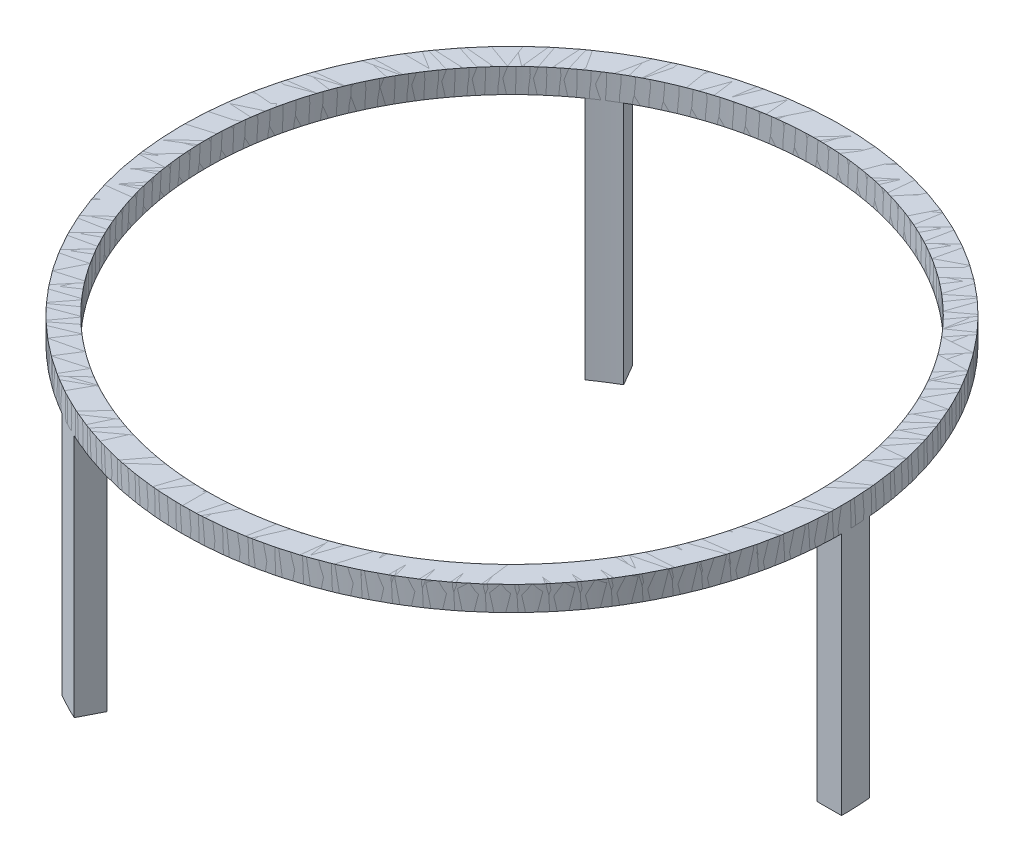
ISO-10303-21;
HEADER;
FILE_DESCRIPTION(('STEP AP214'),'2;1');
FILE_NAME('part.step','',(''),(''),'','','');
FILE_SCHEMA(('AUTOMOTIVE_DESIGN { 1 0 10303 214 1 1 1 1 }'));
ENDSEC;
DATA;
#1=APPLICATION_CONTEXT('core data for automotive mechanical design processes');
#2=APPLICATION_PROTOCOL_DEFINITION('international standard','automotive_design',2000,#1);
#3=PRODUCT_CONTEXT('',#1,'mechanical');
#4=PRODUCT('Part','Part','',(#3));
#5=PRODUCT_RELATED_PRODUCT_CATEGORY('part','',(#4));
#6=PRODUCT_DEFINITION_FORMATION('','',#4);
#7=PRODUCT_DEFINITION_CONTEXT('part definition',#1,'design');
#8=PRODUCT_DEFINITION('design','',#6,#7);
#9=PRODUCT_DEFINITION_SHAPE('','',#8);
#10=(LENGTH_UNIT() NAMED_UNIT(*) SI_UNIT(.MILLI.,.METRE.));
#11=(NAMED_UNIT(*) PLANE_ANGLE_UNIT() SI_UNIT($,.RADIAN.));
#12=(NAMED_UNIT(*) SI_UNIT($,.STERADIAN.) SOLID_ANGLE_UNIT());
#13=UNCERTAINTY_MEASURE_WITH_UNIT(LENGTH_MEASURE(1.E-05),#10,'distance_accuracy_value','');
#14=(GEOMETRIC_REPRESENTATION_CONTEXT(3) GLOBAL_UNCERTAINTY_ASSIGNED_CONTEXT((#13)) GLOBAL_UNIT_ASSIGNED_CONTEXT((#10,
#11,#12)) REPRESENTATION_CONTEXT('',''));
#15=CARTESIAN_POINT('',(0.,0.,0.));
#16=DIRECTION('',(0.,0.,1.));
#17=DIRECTION('',(1.,0.,0.));
#18=AXIS2_PLACEMENT_3D('',#15,#16,#17);
#19=CARTESIAN_POINT('',(0.,0.,0.));
#20=DIRECTION('',(0.,1.,0.));
#21=DIRECTION('',(-0.866025403784443,0.,-0.499999999999992));
#22=AXIS2_PLACEMENT_3D('',#19,#20,#21);
#23=PLANE('',#22);
#24=DIRECTION('',(0.498236668849339,0.,-0.867041072737569));
#25=VECTOR('',#24,1.);
#26=CARTESIAN_POINT('',(-62.499999999999,0.,108.253175473055));
#27=LINE('',#26,#25);
#28=CARTESIAN_POINT('',(-67.4823762401687,0.,116.923602822443));
#29=VERTEX_POINT('',#28);
#30=CARTESIAN_POINT('',(-62.499999999999,0.,108.253175473055));
#31=VERTEX_POINT('',#30);
#32=EDGE_CURVE('E111',#29,#31,#27,.T.);
#33=ORIENTED_EDGE('',*,*,#32,.F.);
#34=CARTESIAN_POINT('',(0.,0.,0.));
#35=DIRECTION('',(0.,1.,0.));
#36=DIRECTION('',(-0.866025403784443,0.,-0.499999999999992));
#37=AXIS2_PLACEMENT_3D('',#34,#35,#36);
#38=CIRCLE('',#37,135.);
#39=CARTESIAN_POINT('',(-56.9282208981994,0.,122.409875685607));
#40=VERTEX_POINT('',#39);
#41=EDGE_CURVE('E54',#40,#29,#38,.T.);
#42=ORIENTED_EDGE('',*,*,#41,.F.);
#43=DIRECTION('',(-0.456347061510745,0.,0.889801865277045));
#44=VECTOR('',#43,1.);
#45=CARTESIAN_POINT('',(-52.3610804507896,0.,113.504701462212));
#46=LINE('',#45,#44);
#47=CARTESIAN_POINT('',(-52.3610804507896,0.,113.504701462212));
#48=VERTEX_POINT('',#47);
#49=EDGE_CURVE('E66',#48,#40,#46,.T.);
#50=ORIENTED_EDGE('',*,*,#49,.F.);
#51=CARTESIAN_POINT('',(0.,0.,0.));
#52=DIRECTION('',(0.,1.,0.));
#53=DIRECTION('',(-0.866025403784443,0.,-0.499999999999992));
#54=AXIS2_PLACEMENT_3D('',#51,#52,#53);
#55=CIRCLE('',#54,125.);
#56=EDGE_CURVE('E70',#48,#31,#55,.T.);
#57=ORIENTED_EDGE('',*,*,#56,.T.);
#58=EDGE_LOOP('',(#33,#42,#50,#57));
#59=FACE_BOUND('',#58,.T.);
#60=ADVANCED_FACE('F50',(#59),#23,.F.);
#61=CARTESIAN_POINT('',(0.,10.,0.));
#62=DIRECTION('',(0.,1.,0.));
#63=DIRECTION('',(-0.866025403784443,0.,-0.499999999999992));
#64=AXIS2_PLACEMENT_3D('',#61,#62,#63);
#65=PLANE('',#64);
#66=CARTESIAN_POINT('',(0.,10.,0.));
#67=DIRECTION('',(0.,1.,0.));
#68=DIRECTION('',(-0.866025403784443,0.,-0.499999999999992));
#69=AXIS2_PLACEMENT_3D('',#66,#67,#68);
#70=CIRCLE('',#69,135.);
#71=CARTESIAN_POINT('',(-116.9134295109,10.,-67.4999999999989));
#72=VERTEX_POINT('',#71);
#73=EDGE_CURVE('E12',#72,#72,#70,.T.);
#74=ORIENTED_EDGE('',*,*,#73,.T.);
#75=EDGE_LOOP('',(#74));
#76=FACE_BOUND('',#75,.T.);
#77=CARTESIAN_POINT('',(0.,10.,0.));
#78=DIRECTION('',(0.,1.,0.));
#79=DIRECTION('',(-0.866025403784443,0.,-0.499999999999992));
#80=AXIS2_PLACEMENT_3D('',#77,#78,#79);
#81=CIRCLE('',#80,125.);
#82=CARTESIAN_POINT('',(-108.253175473055,10.,-62.499999999999));
#83=VERTEX_POINT('',#82);
#84=EDGE_CURVE('E118',#83,#83,#81,.T.);
#85=ORIENTED_EDGE('',*,*,#84,.F.);
#86=EDGE_LOOP('',(#85));
#87=FACE_BOUND('',#86,.T.);
#88=ADVANCED_FACE('F148',(#76,#87),#65,.T.);
#89=CARTESIAN_POINT('',(0.,10.,0.));
#90=DIRECTION('',(0.,-1.,0.));
#91=DIRECTION('',(0.866025403784443,0.,0.499999999999992));
#92=AXIS2_PLACEMENT_3D('',#89,#90,#91);
#93=CYLINDRICAL_SURFACE('',#92,135.);
#94=ORIENTED_EDGE('',*,*,#73,.F.);
#95=EDGE_LOOP('',(#94));
#96=FACE_BOUND('',#95,.T.);
#97=ORIENTED_EDGE('',*,*,#41,.T.);
#98=DIRECTION('',(0.,1.,0.));
#99=VECTOR('',#98,1.);
#100=CARTESIAN_POINT('',(-67.4823762401687,-100.,116.923602822443));
#101=LINE('',#100,#99);
#102=CARTESIAN_POINT('',(-67.4823762401687,-100.,116.923602822443));
#103=VERTEX_POINT('',#102);
#104=EDGE_CURVE('E120',#103,#29,#101,.T.);
#105=ORIENTED_EDGE('',*,*,#104,.F.);
#106=CARTESIAN_POINT('',(0.,-100.,0.));
#107=DIRECTION('',(0.,-1.,0.));
#108=DIRECTION('',(-0.866025403784443,0.,-0.499999999999992));
#109=AXIS2_PLACEMENT_3D('',#106,#107,#108);
#110=CIRCLE('',#109,135.);
#111=CARTESIAN_POINT('',(-56.9282208981994,-100.,122.409875685607));
#112=VERTEX_POINT('',#111);
#113=EDGE_CURVE('E100',#112,#103,#110,.T.);
#114=ORIENTED_EDGE('',*,*,#113,.F.);
#115=DIRECTION('',(0.,1.,0.));
#116=VECTOR('',#115,1.);
#117=CARTESIAN_POINT('',(-56.9282208981994,-100.,122.409875685607));
#118=LINE('',#117,#116);
#119=EDGE_CURVE('E96',#112,#40,#118,.T.);
#120=ORIENTED_EDGE('',*,*,#119,.T.);
#121=EDGE_LOOP('',(#97,#105,#114,#120));
#122=FACE_BOUND('',#121,.T.);
#123=ADVANCED_FACE('F52',(#96,#122),#93,.T.);
#124=CARTESIAN_POINT('',(0.,10.,0.));
#125=DIRECTION('',(0.,-1.,0.));
#126=DIRECTION('',(0.866025403784443,0.,0.499999999999992));
#127=AXIS2_PLACEMENT_3D('',#124,#125,#126);
#128=CYLINDRICAL_SURFACE('',#127,125.);
#129=ORIENTED_EDGE('',*,*,#84,.T.);
#130=EDGE_LOOP('',(#129));
#131=FACE_BOUND('',#130,.T.);
#132=ORIENTED_EDGE('',*,*,#56,.F.);
#133=DIRECTION('',(0.,1.,0.));
#134=VECTOR('',#133,1.);
#135=CARTESIAN_POINT('',(-52.3610804507896,-100.,113.504701462212));
#136=LINE('',#135,#134);
#137=CARTESIAN_POINT('',(-52.3610804507896,-100.,113.504701462212));
#138=VERTEX_POINT('',#137);
#139=EDGE_CURVE('E94',#138,#48,#136,.T.);
#140=ORIENTED_EDGE('',*,*,#139,.F.);
#141=CARTESIAN_POINT('',(0.,-100.,0.));
#142=DIRECTION('',(0.,1.,0.));
#143=DIRECTION('',(-0.866025403784443,0.,-0.499999999999992));
#144=AXIS2_PLACEMENT_3D('',#141,#142,#143);
#145=CIRCLE('',#144,125.);
#146=CARTESIAN_POINT('',(-62.499999999999,-100.,108.253175473055));
#147=VERTEX_POINT('',#146);
#148=EDGE_CURVE('E101',#147,#138,#145,.T.);
#149=ORIENTED_EDGE('',*,*,#148,.F.);
#150=DIRECTION('',(0.,1.,0.));
#151=VECTOR('',#150,1.);
#152=CARTESIAN_POINT('',(-62.499999999999,-100.,108.253175473055));
#153=LINE('',#152,#151);
#154=EDGE_CURVE('E136',#147,#31,#153,.T.);
#155=ORIENTED_EDGE('',*,*,#154,.T.);
#156=EDGE_LOOP('',(#132,#140,#149,#155));
#157=FACE_BOUND('',#156,.T.);
#158=ADVANCED_FACE('F113',(#131,#157),#128,.F.);
#159=CARTESIAN_POINT('',(-52.3610804507896,-100.,113.504701462212));
#160=DIRECTION('',(-0.889801865277045,0.,-0.456347061510745));
#161=DIRECTION('',(-0.456347061510745,0.,0.889801865277045));
#162=AXIS2_PLACEMENT_3D('',#159,#160,#161);
#163=PLANE('',#162);
#164=ORIENTED_EDGE('',*,*,#49,.T.);
#165=ORIENTED_EDGE('',*,*,#119,.F.);
#166=DIRECTION('',(-0.456347061510745,0.,0.889801865277045));
#167=VECTOR('',#166,1.);
#168=CARTESIAN_POINT('',(-52.3610804507896,-100.,113.504701462212));
#169=LINE('',#168,#167);
#170=EDGE_CURVE('E90',#138,#112,#169,.T.);
#171=ORIENTED_EDGE('',*,*,#170,.F.);
#172=ORIENTED_EDGE('',*,*,#139,.T.);
#173=EDGE_LOOP('',(#164,#165,#171,#172));
#174=FACE_BOUND('',#173,.T.);
#175=ADVANCED_FACE('F92',(#174),#163,.F.);
#176=CARTESIAN_POINT('',(-62.499999999999,-100.,108.253175473055));
#177=DIRECTION('',(0.867041072737569,0.,0.498236668849339));
#178=DIRECTION('',(0.498236668849339,0.,-0.867041072737569));
#179=AXIS2_PLACEMENT_3D('',#176,#177,#178);
#180=PLANE('',#179);
#181=ORIENTED_EDGE('',*,*,#32,.T.);
#182=ORIENTED_EDGE('',*,*,#154,.F.);
#183=DIRECTION('',(0.498236668849339,0.,-0.867041072737569));
#184=VECTOR('',#183,1.);
#185=CARTESIAN_POINT('',(-62.499999999999,-100.,108.253175473055));
#186=LINE('',#185,#184);
#187=EDGE_CURVE('E106',#103,#147,#186,.T.);
#188=ORIENTED_EDGE('',*,*,#187,.F.);
#189=ORIENTED_EDGE('',*,*,#104,.T.);
#190=EDGE_LOOP('',(#181,#182,#188,#189));
#191=FACE_BOUND('',#190,.T.);
#192=ADVANCED_FACE('F134',(#191),#180,.F.);
#193=CARTESIAN_POINT('',(0.,-100.,0.));
#194=DIRECTION('',(0.,1.,0.));
#195=DIRECTION('',(-0.866025403784443,0.,-0.499999999999992));
#196=AXIS2_PLACEMENT_3D('',#193,#194,#195);
#197=PLANE('',#196);
#198=ORIENTED_EDGE('',*,*,#148,.T.);
#199=ORIENTED_EDGE('',*,*,#170,.T.);
#200=ORIENTED_EDGE('',*,*,#113,.T.);
#201=ORIENTED_EDGE('',*,*,#187,.T.);
#202=EDGE_LOOP('',(#198,#199,#200,#201));
#203=FACE_BOUND('',#202,.T.);
#204=ADVANCED_FACE('F104',(#203),#197,.F.);
#205=CLOSED_SHELL('',(#60,#88,#123,#158,#175,#192,#204));
#206=MANIFOLD_SOLID_BREP('B2',#205);
#207=CARTESIAN_POINT('',(0.,0.,0.));
#208=DIRECTION('',(0.,1.,0.));
#209=DIRECTION('',(0.866025403784436,0.,-0.500000000000004));
#210=AXIS2_PLACEMENT_3D('',#207,#208,#209);
#211=PLANE('',#210);
#212=DIRECTION('',(0.501761260690572,0.,0.865006148689249));
#213=VECTOR('',#212,1.);
#214=CARTESIAN_POINT('',(-62.5000000000005,0.,-108.253175473055));
#215=LINE('',#214,#213);
#216=CARTESIAN_POINT('',(-67.5176222261524,0.,-116.903253542947));
#217=VERTEX_POINT('',#216);
#218=CARTESIAN_POINT('',(-62.5000000000005,0.,-108.253175473055));
#219=VERTEX_POINT('',#218);
#220=EDGE_CURVE('E282',#217,#219,#215,.T.);
#221=ORIENTED_EDGE('',*,*,#220,.F.);
#222=CARTESIAN_POINT('',(0.,0.,0.));
#223=DIRECTION('',(0.,1.,0.));
#224=DIRECTION('',(0.866025403784436,0.,-0.500000000000004));
#225=AXIS2_PLACEMENT_3D('',#222,#223,#224);
#226=CIRCLE('',#225,135.);
#227=CARTESIAN_POINT('',(-77.5459515687307,0.,-110.506223332897));
#228=VERTEX_POINT('',#227);
#229=EDGE_CURVE('E228',#228,#217,#226,.T.);
#230=ORIENTED_EDGE('',*,*,#229,.F.);
#231=DIRECTION('',(-0.542417488909323,0.,-0.84010908084921));
#232=VECTOR('',#231,1.);
#233=CARTESIAN_POINT('',(-72.1174146898493,0.,-102.098376571091));
#234=LINE('',#233,#232);
#235=CARTESIAN_POINT('',(-72.1174146898494,0.,-102.098376571091));
#236=VERTEX_POINT('',#235);
#237=EDGE_CURVE('E239',#236,#228,#234,.T.);
#238=ORIENTED_EDGE('',*,*,#237,.F.);
#239=CARTESIAN_POINT('',(0.,0.,0.));
#240=DIRECTION('',(0.,1.,0.));
#241=DIRECTION('',(0.866025403784436,0.,-0.500000000000004));
#242=AXIS2_PLACEMENT_3D('',#239,#240,#241);
#243=CIRCLE('',#242,125.);
#244=EDGE_CURVE('E243',#236,#219,#243,.T.);
#245=ORIENTED_EDGE('',*,*,#244,.T.);
#246=EDGE_LOOP('',(#221,#230,#238,#245));
#247=FACE_BOUND('',#246,.T.);
#248=ADVANCED_FACE('F224',(#247),#211,.F.);
#249=CARTESIAN_POINT('',(0.,10.,0.));
#250=DIRECTION('',(0.,1.,0.));
#251=DIRECTION('',(0.866025403784436,0.,-0.500000000000004));
#252=AXIS2_PLACEMENT_3D('',#249,#250,#251);
#253=PLANE('',#252);
#254=CARTESIAN_POINT('',(0.,10.,0.));
#255=DIRECTION('',(0.,1.,0.));
#256=DIRECTION('',(0.866025403784436,0.,-0.500000000000004));
#257=AXIS2_PLACEMENT_3D('',#254,#255,#256);
#258=CIRCLE('',#257,135.);
#259=CARTESIAN_POINT('',(116.913429510899,10.,-67.5000000000006));
#260=VERTEX_POINT('',#259);
#261=EDGE_CURVE('E48',#260,#260,#258,.T.);
#262=ORIENTED_EDGE('',*,*,#261,.T.);
#263=EDGE_LOOP('',(#262));
#264=FACE_BOUND('',#263,.T.);
#265=CARTESIAN_POINT('',(0.,10.,0.));
#266=DIRECTION('',(0.,1.,0.));
#267=DIRECTION('',(0.866025403784436,0.,-0.500000000000004));
#268=AXIS2_PLACEMENT_3D('',#265,#266,#267);
#269=CIRCLE('',#268,125.);
#270=CARTESIAN_POINT('',(108.253175473055,10.,-62.5000000000005));
#271=VERTEX_POINT('',#270);
#272=EDGE_CURVE('E286',#271,#271,#269,.T.);
#273=ORIENTED_EDGE('',*,*,#272,.F.);
#274=EDGE_LOOP('',(#273));
#275=FACE_BOUND('',#274,.T.);
#276=ADVANCED_FACE('F308',(#264,#275),#253,.T.);
#277=CARTESIAN_POINT('',(0.,10.,0.));
#278=DIRECTION('',(0.,-1.,0.));
#279=DIRECTION('',(-0.866025403784436,0.,0.500000000000004));
#280=AXIS2_PLACEMENT_3D('',#277,#278,#279);
#281=CYLINDRICAL_SURFACE('',#280,135.);
#282=ORIENTED_EDGE('',*,*,#261,.F.);
#283=EDGE_LOOP('',(#282));
#284=FACE_BOUND('',#283,.T.);
#285=ORIENTED_EDGE('',*,*,#229,.T.);
#286=DIRECTION('',(0.,1.,0.));
#287=VECTOR('',#286,1.);
#288=CARTESIAN_POINT('',(-67.5176222261524,-100.,-116.903253542947));
#289=LINE('',#288,#287);
#290=CARTESIAN_POINT('',(-67.5176222261524,-100.,-116.903253542947));
#291=VERTEX_POINT('',#290);
#292=EDGE_CURVE('E288',#291,#217,#289,.T.);
#293=ORIENTED_EDGE('',*,*,#292,.F.);
#294=CARTESIAN_POINT('',(0.,-100.,0.));
#295=DIRECTION('',(0.,-1.,0.));
#296=DIRECTION('',(0.866025403784436,0.,-0.500000000000004));
#297=AXIS2_PLACEMENT_3D('',#294,#295,#296);
#298=CIRCLE('',#297,135.);
#299=CARTESIAN_POINT('',(-77.5459515687307,-100.,-110.506223332897));
#300=VERTEX_POINT('',#299);
#301=EDGE_CURVE('E272',#300,#291,#298,.T.);
#302=ORIENTED_EDGE('',*,*,#301,.F.);
#303=DIRECTION('',(0.,1.,0.));
#304=VECTOR('',#303,1.);
#305=CARTESIAN_POINT('',(-77.5459515687307,-100.,-110.506223332897));
#306=LINE('',#305,#304);
#307=EDGE_CURVE('E269',#300,#228,#306,.T.);
#308=ORIENTED_EDGE('',*,*,#307,.T.);
#309=EDGE_LOOP('',(#285,#293,#302,#308));
#310=FACE_BOUND('',#309,.T.);
#311=ADVANCED_FACE('F226',(#284,#310),#281,.T.);
#312=CARTESIAN_POINT('',(0.,10.,0.));
#313=DIRECTION('',(0.,-1.,0.));
#314=DIRECTION('',(-0.866025403784436,0.,0.500000000000004));
#315=AXIS2_PLACEMENT_3D('',#312,#313,#314);
#316=CYLINDRICAL_SURFACE('',#315,125.);
#317=ORIENTED_EDGE('',*,*,#272,.T.);
#318=EDGE_LOOP('',(#317));
#319=FACE_BOUND('',#318,.T.);
#320=ORIENTED_EDGE('',*,*,#244,.F.);
#321=DIRECTION('',(0.,1.,0.));
#322=VECTOR('',#321,1.);
#323=CARTESIAN_POINT('',(-72.1174146898493,-100.,-102.098376571091));
#324=LINE('',#323,#322);
#325=CARTESIAN_POINT('',(-72.1174146898493,-100.,-102.098376571091));
#326=VERTEX_POINT('',#325);
#327=EDGE_CURVE('E267',#326,#236,#324,.T.);
#328=ORIENTED_EDGE('',*,*,#327,.F.);
#329=CARTESIAN_POINT('',(0.,-100.,0.));
#330=DIRECTION('',(0.,1.,0.));
#331=DIRECTION('',(0.866025403784436,0.,-0.500000000000004));
#332=AXIS2_PLACEMENT_3D('',#329,#330,#331);
#333=CIRCLE('',#332,125.);
#334=CARTESIAN_POINT('',(-62.5000000000005,-100.,-108.253175473055));
#335=VERTEX_POINT('',#334);
#336=EDGE_CURVE('E273',#335,#326,#333,.T.);
#337=ORIENTED_EDGE('',*,*,#336,.F.);
#338=DIRECTION('',(0.,1.,0.));
#339=VECTOR('',#338,1.);
#340=CARTESIAN_POINT('',(-62.5000000000005,-100.,-108.253175473055));
#341=LINE('',#340,#339);
#342=EDGE_CURVE('E301',#335,#219,#341,.T.);
#343=ORIENTED_EDGE('',*,*,#342,.T.);
#344=EDGE_LOOP('',(#320,#328,#337,#343));
#345=FACE_BOUND('',#344,.T.);
#346=ADVANCED_FACE('F284',(#319,#345),#316,.F.);
#347=CARTESIAN_POINT('',(-72.1174146898493,-100.,-102.098376571091));
#348=DIRECTION('',(0.84010908084921,0.,-0.542417488909323));
#349=DIRECTION('',(-0.542417488909323,0.,-0.84010908084921));
#350=AXIS2_PLACEMENT_3D('',#347,#348,#349);
#351=PLANE('',#350);
#352=ORIENTED_EDGE('',*,*,#237,.T.);
#353=ORIENTED_EDGE('',*,*,#307,.F.);
#354=DIRECTION('',(-0.542417488909323,0.,-0.84010908084921));
#355=VECTOR('',#354,1.);
#356=CARTESIAN_POINT('',(-72.1174146898493,-100.,-102.098376571091));
#357=LINE('',#356,#355);
#358=EDGE_CURVE('E263',#326,#300,#357,.T.);
#359=ORIENTED_EDGE('',*,*,#358,.F.);
#360=ORIENTED_EDGE('',*,*,#327,.T.);
#361=EDGE_LOOP('',(#352,#353,#359,#360));
#362=FACE_BOUND('',#361,.T.);
#363=ADVANCED_FACE('F265',(#362),#351,.F.);
#364=CARTESIAN_POINT('',(-62.5000000000005,-100.,-108.253175473055));
#365=DIRECTION('',(-0.865006148689249,0.,0.501761260690572));
#366=DIRECTION('',(0.501761260690572,0.,0.865006148689249));
#367=AXIS2_PLACEMENT_3D('',#364,#365,#366);
#368=PLANE('',#367);
#369=ORIENTED_EDGE('',*,*,#220,.T.);
#370=ORIENTED_EDGE('',*,*,#342,.F.);
#371=DIRECTION('',(0.501761260690572,0.,0.865006148689249));
#372=VECTOR('',#371,1.);
#373=CARTESIAN_POINT('',(-62.5000000000005,-100.,-108.253175473055));
#374=LINE('',#373,#372);
#375=EDGE_CURVE('E278',#291,#335,#374,.T.);
#376=ORIENTED_EDGE('',*,*,#375,.F.);
#377=ORIENTED_EDGE('',*,*,#292,.T.);
#378=EDGE_LOOP('',(#369,#370,#376,#377));
#379=FACE_BOUND('',#378,.T.);
#380=ADVANCED_FACE('F300',(#379),#368,.F.);
#381=CARTESIAN_POINT('',(0.,-100.,0.));
#382=DIRECTION('',(0.,1.,0.));
#383=DIRECTION('',(0.866025403784436,0.,-0.500000000000004));
#384=AXIS2_PLACEMENT_3D('',#381,#382,#383);
#385=PLANE('',#384);
#386=ORIENTED_EDGE('',*,*,#336,.T.);
#387=ORIENTED_EDGE('',*,*,#358,.T.);
#388=ORIENTED_EDGE('',*,*,#301,.T.);
#389=ORIENTED_EDGE('',*,*,#375,.T.);
#390=EDGE_LOOP('',(#386,#387,#388,#389));
#391=FACE_BOUND('',#390,.T.);
#392=ADVANCED_FACE('F276',(#391),#385,.F.);
#393=CLOSED_SHELL('',(#248,#276,#311,#346,#363,#380,#392));
#394=MANIFOLD_SOLID_BREP('B6',#393);
#395=CARTESIAN_POINT('',(0.,0.,0.));
#396=DIRECTION('',(0.,1.,0.));
#397=DIRECTION('',(0.,0.,1.));
#398=AXIS2_PLACEMENT_3D('',#395,#396,#397);
#399=PLANE('',#398);
#400=DIRECTION('',(-0.999997929539915,0.,0.00203492404831269));
#401=VECTOR('',#400,1.);
#402=CARTESIAN_POINT('',(125.,0.,0.));
#403=LINE('',#402,#401);
#404=CARTESIAN_POINT('',(134.999998466322,0.,-0.0203492794945788));
#405=VERTEX_POINT('',#404);
#406=CARTESIAN_POINT('',(125.,0.,0.));
#407=VERTEX_POINT('',#406);
#408=EDGE_CURVE('E433',#405,#407,#403,.T.);
#409=ORIENTED_EDGE('',*,*,#408,.F.);
#410=CARTESIAN_POINT('',(0.,0.,0.));
#411=DIRECTION('',(0.,1.,0.));
#412=DIRECTION('',(0.,0.,1.));
#413=AXIS2_PLACEMENT_3D('',#410,#411,#412);
#414=CIRCLE('',#413,135.);
#415=CARTESIAN_POINT('',(134.474172466931,0.,-11.9036523527095));
#416=VERTEX_POINT('',#415);
#417=EDGE_CURVE('E379',#416,#405,#414,.T.);
#418=ORIENTED_EDGE('',*,*,#417,.F.);
#419=DIRECTION('',(0.998764550420073,0.,-0.0496927844278281));
#420=VECTOR('',#419,1.);
#421=CARTESIAN_POINT('',(124.478495140639,0.,-11.4063248911205));
#422=LINE('',#421,#420);
#423=CARTESIAN_POINT('',(124.478495140639,0.,-11.4063248911205));
#424=VERTEX_POINT('',#423);
#425=EDGE_CURVE('E390',#424,#416,#422,.T.);
#426=ORIENTED_EDGE('',*,*,#425,.F.);
#427=CARTESIAN_POINT('',(0.,0.,0.));
#428=DIRECTION('',(0.,1.,0.));
#429=DIRECTION('',(0.,0.,1.));
#430=AXIS2_PLACEMENT_3D('',#427,#428,#429);
#431=CIRCLE('',#430,125.);
#432=EDGE_CURVE('E394',#424,#407,#431,.T.);
#433=ORIENTED_EDGE('',*,*,#432,.T.);
#434=EDGE_LOOP('',(#409,#418,#426,#433));
#435=FACE_BOUND('',#434,.T.);
#436=ADVANCED_FACE('F375',(#435),#399,.F.);
#437=CARTESIAN_POINT('',(0.,10.,0.));
#438=DIRECTION('',(0.,1.,0.));
#439=DIRECTION('',(0.,0.,1.));
#440=AXIS2_PLACEMENT_3D('',#437,#438,#439);
#441=PLANE('',#440);
#442=CARTESIAN_POINT('',(0.,10.,0.));
#443=DIRECTION('',(0.,1.,0.));
#444=DIRECTION('',(0.,0.,1.));
#445=AXIS2_PLACEMENT_3D('',#442,#443,#444);
#446=CIRCLE('',#445,135.);
#447=CARTESIAN_POINT('',(0.,10.,135.));
#448=VERTEX_POINT('',#447);
#449=EDGE_CURVE('E222',#448,#448,#446,.T.);
#450=ORIENTED_EDGE('',*,*,#449,.T.);
#451=EDGE_LOOP('',(#450));
#452=FACE_BOUND('',#451,.T.);
#453=CARTESIAN_POINT('',(0.,10.,0.));
#454=DIRECTION('',(0.,1.,0.));
#455=DIRECTION('',(0.,0.,1.));
#456=AXIS2_PLACEMENT_3D('',#453,#454,#455);
#457=CIRCLE('',#456,125.);
#458=CARTESIAN_POINT('',(0.,10.,125.));
#459=VERTEX_POINT('',#458);
#460=EDGE_CURVE('E437',#459,#459,#457,.T.);
#461=ORIENTED_EDGE('',*,*,#460,.F.);
#462=EDGE_LOOP('',(#461));
#463=FACE_BOUND('',#462,.T.);
#464=ADVANCED_FACE('F459',(#452,#463),#441,.T.);
#465=CARTESIAN_POINT('',(0.,10.,0.));
#466=DIRECTION('',(0.,-1.,0.));
#467=DIRECTION('',(0.,0.,-1.));
#468=AXIS2_PLACEMENT_3D('',#465,#466,#467);
#469=CYLINDRICAL_SURFACE('',#468,135.);
#470=ORIENTED_EDGE('',*,*,#449,.F.);
#471=EDGE_LOOP('',(#470));
#472=FACE_BOUND('',#471,.T.);
#473=ORIENTED_EDGE('',*,*,#417,.T.);
#474=DIRECTION('',(0.,1.,0.));
#475=VECTOR('',#474,1.);
#476=CARTESIAN_POINT('',(134.999998466322,-100.,-0.0203492794945787));
#477=LINE('',#476,#475);
#478=CARTESIAN_POINT('',(134.999998466322,-100.,-0.0203492794945787));
#479=VERTEX_POINT('',#478);
#480=EDGE_CURVE('E439',#479,#405,#477,.T.);
#481=ORIENTED_EDGE('',*,*,#480,.F.);
#482=CARTESIAN_POINT('',(0.,-100.,0.));
#483=DIRECTION('',(0.,-1.,0.));
#484=DIRECTION('',(0.,0.,1.));
#485=AXIS2_PLACEMENT_3D('',#482,#483,#484);
#486=CIRCLE('',#485,135.);
#487=CARTESIAN_POINT('',(134.474172466931,-100.,-11.9036523527095));
#488=VERTEX_POINT('',#487);
#489=EDGE_CURVE('E423',#488,#479,#486,.T.);
#490=ORIENTED_EDGE('',*,*,#489,.F.);
#491=DIRECTION('',(0.,1.,0.));
#492=VECTOR('',#491,1.);
#493=CARTESIAN_POINT('',(134.474172466931,-100.,-11.9036523527095));
#494=LINE('',#493,#492);
#495=EDGE_CURVE('E420',#488,#416,#494,.T.);
#496=ORIENTED_EDGE('',*,*,#495,.T.);
#497=EDGE_LOOP('',(#473,#481,#490,#496));
#498=FACE_BOUND('',#497,.T.);
#499=ADVANCED_FACE('F377',(#472,#498),#469,.T.);
#500=CARTESIAN_POINT('',(0.,10.,0.));
#501=DIRECTION('',(0.,-1.,0.));
#502=DIRECTION('',(0.,0.,-1.));
#503=AXIS2_PLACEMENT_3D('',#500,#501,#502);
#504=CYLINDRICAL_SURFACE('',#503,125.);
#505=ORIENTED_EDGE('',*,*,#460,.T.);
#506=EDGE_LOOP('',(#505));
#507=FACE_BOUND('',#506,.T.);
#508=ORIENTED_EDGE('',*,*,#432,.F.);
#509=DIRECTION('',(0.,1.,0.));
#510=VECTOR('',#509,1.);
#511=CARTESIAN_POINT('',(124.478495140639,-100.,-11.4063248911205));
#512=LINE('',#511,#510);
#513=CARTESIAN_POINT('',(124.478495140639,-100.,-11.4063248911205));
#514=VERTEX_POINT('',#513);
#515=EDGE_CURVE('E418',#514,#424,#512,.T.);
#516=ORIENTED_EDGE('',*,*,#515,.F.);
#517=CARTESIAN_POINT('',(0.,-100.,0.));
#518=DIRECTION('',(0.,1.,0.));
#519=DIRECTION('',(0.,0.,1.));
#520=AXIS2_PLACEMENT_3D('',#517,#518,#519);
#521=CIRCLE('',#520,125.);
#522=CARTESIAN_POINT('',(125.,-100.,0.));
#523=VERTEX_POINT('',#522);
#524=EDGE_CURVE('E424',#523,#514,#521,.T.);
#525=ORIENTED_EDGE('',*,*,#524,.F.);
#526=DIRECTION('',(0.,1.,0.));
#527=VECTOR('',#526,1.);
#528=CARTESIAN_POINT('',(125.,-100.,0.));
#529=LINE('',#528,#527);
#530=EDGE_CURVE('E452',#523,#407,#529,.T.);
#531=ORIENTED_EDGE('',*,*,#530,.T.);
#532=EDGE_LOOP('',(#508,#516,#525,#531));
#533=FACE_BOUND('',#532,.T.);
#534=ADVANCED_FACE('F435',(#507,#533),#504,.F.);
#535=CARTESIAN_POINT('',(124.478495140639,-100.,-11.4063248911205));
#536=DIRECTION('',(0.0496927844278281,0.,0.998764550420072));
#537=DIRECTION('',(0.998764550420073,0.,-0.0496927844278281));
#538=AXIS2_PLACEMENT_3D('',#535,#536,#537);
#539=PLANE('',#538);
#540=ORIENTED_EDGE('',*,*,#425,.T.);
#541=ORIENTED_EDGE('',*,*,#495,.F.);
#542=DIRECTION('',(0.998764550420073,0.,-0.0496927844278281));
#543=VECTOR('',#542,1.);
#544=CARTESIAN_POINT('',(124.478495140639,-100.,-11.4063248911205));
#545=LINE('',#544,#543);
#546=EDGE_CURVE('E414',#514,#488,#545,.T.);
#547=ORIENTED_EDGE('',*,*,#546,.F.);
#548=ORIENTED_EDGE('',*,*,#515,.T.);
#549=EDGE_LOOP('',(#540,#541,#547,#548));
#550=FACE_BOUND('',#549,.T.);
#551=ADVANCED_FACE('F416',(#550),#539,.F.);
#552=CARTESIAN_POINT('',(125.,-100.,0.));
#553=DIRECTION('',(-0.00203492404831269,0.,-0.999997929539915));
#554=DIRECTION('',(-0.999997929539915,0.,0.00203492404831269));
#555=AXIS2_PLACEMENT_3D('',#552,#553,#554);
#556=PLANE('',#555);
#557=ORIENTED_EDGE('',*,*,#408,.T.);
#558=ORIENTED_EDGE('',*,*,#530,.F.);
#559=DIRECTION('',(-0.999997929539915,0.,0.00203492404831269));
#560=VECTOR('',#559,1.);
#561=CARTESIAN_POINT('',(125.,-100.,0.));
#562=LINE('',#561,#560);
#563=EDGE_CURVE('E429',#479,#523,#562,.T.);
#564=ORIENTED_EDGE('',*,*,#563,.F.);
#565=ORIENTED_EDGE('',*,*,#480,.T.);
#566=EDGE_LOOP('',(#557,#558,#564,#565));
#567=FACE_BOUND('',#566,.T.);
#568=ADVANCED_FACE('F451',(#567),#556,.F.);
#569=CARTESIAN_POINT('',(0.,-100.,0.));
#570=DIRECTION('',(0.,1.,0.));
#571=DIRECTION('',(0.,0.,1.));
#572=AXIS2_PLACEMENT_3D('',#569,#570,#571);
#573=PLANE('',#572);
#574=ORIENTED_EDGE('',*,*,#524,.T.);
#575=ORIENTED_EDGE('',*,*,#546,.T.);
#576=ORIENTED_EDGE('',*,*,#489,.T.);
#577=ORIENTED_EDGE('',*,*,#563,.T.);
#578=EDGE_LOOP('',(#574,#575,#576,#577));
#579=FACE_BOUND('',#578,.T.);
#580=ADVANCED_FACE('F427',(#579),#573,.F.);
#581=CLOSED_SHELL('',(#436,#464,#499,#534,#551,#568,#580));
#582=MANIFOLD_SOLID_BREP('B42',#581);
#583=ADVANCED_BREP_SHAPE_REPRESENTATION('',(#18,#206,#394,#582),#14);
#584=SHAPE_DEFINITION_REPRESENTATION(#9,#583);
ENDSEC;
END-ISO-10303-21;
